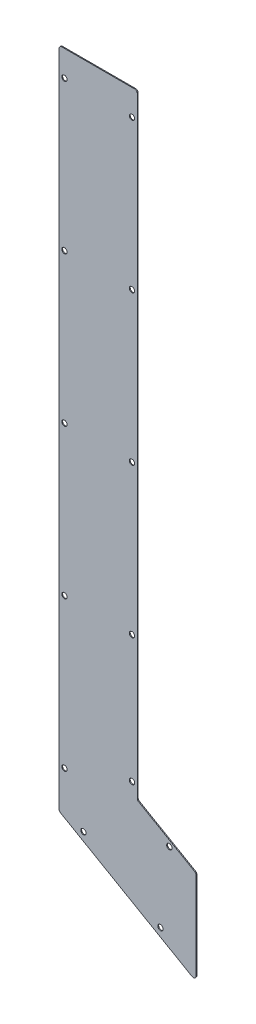
ISO-10303-21;
HEADER;
FILE_DESCRIPTION(('STEP AP214'),'2;1');
FILE_NAME('part.step','',(''),(''),'','','');
FILE_SCHEMA(('AUTOMOTIVE_DESIGN { 1 0 10303 214 1 1 1 1 }'));
ENDSEC;
DATA;
#1=APPLICATION_CONTEXT('core data for automotive mechanical design processes');
#2=APPLICATION_PROTOCOL_DEFINITION('international standard','automotive_design',2000,#1);
#3=PRODUCT_CONTEXT('',#1,'mechanical');
#4=PRODUCT('Part','Part','',(#3));
#5=PRODUCT_RELATED_PRODUCT_CATEGORY('part','',(#4));
#6=PRODUCT_DEFINITION_FORMATION('','',#4);
#7=PRODUCT_DEFINITION_CONTEXT('part definition',#1,'design');
#8=PRODUCT_DEFINITION('design','',#6,#7);
#9=PRODUCT_DEFINITION_SHAPE('','',#8);
#10=(LENGTH_UNIT() NAMED_UNIT(*) SI_UNIT(.MILLI.,.METRE.));
#11=(NAMED_UNIT(*) PLANE_ANGLE_UNIT() SI_UNIT($,.RADIAN.));
#12=(NAMED_UNIT(*) SI_UNIT($,.STERADIAN.) SOLID_ANGLE_UNIT());
#13=UNCERTAINTY_MEASURE_WITH_UNIT(LENGTH_MEASURE(1.E-05),#10,'distance_accuracy_value','');
#14=(GEOMETRIC_REPRESENTATION_CONTEXT(3) GLOBAL_UNCERTAINTY_ASSIGNED_CONTEXT((#13)) GLOBAL_UNIT_ASSIGNED_CONTEXT((#10,
#11,#12)) REPRESENTATION_CONTEXT('',''));
#15=CARTESIAN_POINT('',(0.,0.,0.));
#16=DIRECTION('',(0.,0.,1.));
#17=DIRECTION('',(1.,0.,0.));
#18=AXIS2_PLACEMENT_3D('',#15,#16,#17);
#19=CARTESIAN_POINT('',(104.,161.74,-1.));
#20=DIRECTION('',(1.,0.,0.));
#21=DIRECTION('',(0.,0.,-1.));
#22=AXIS2_PLACEMENT_3D('',#19,#20,#21);
#23=PLANE('',#22);
#24=DIRECTION('',(0.,1.,0.));
#25=VECTOR('',#24,1.);
#26=CARTESIAN_POINT('',(104.,161.74,0.));
#27=LINE('',#26,#25);
#28=CARTESIAN_POINT('',(104.,163.472050807569,0.));
#29=VERTEX_POINT('',#28);
#30=CARTESIAN_POINT('',(104.,850.,0.));
#31=VERTEX_POINT('',#30);
#32=EDGE_CURVE('E203',#29,#31,#27,.T.);
#33=ORIENTED_EDGE('',*,*,#32,.F.);
#34=DIRECTION('',(0.,0.,1.));
#35=VECTOR('',#34,1.);
#36=CARTESIAN_POINT('',(104.,163.472050807569,-1.));
#37=LINE('',#36,#35);
#38=CARTESIAN_POINT('',(104.,163.472050807569,-1.));
#39=VERTEX_POINT('',#38);
#40=EDGE_CURVE('E196',#29,#39,#37,.F.);
#41=ORIENTED_EDGE('',*,*,#40,.T.);
#42=DIRECTION('',(0.,1.,0.));
#43=VECTOR('',#42,1.);
#44=CARTESIAN_POINT('',(104.,161.74,-1.));
#45=LINE('',#44,#43);
#46=CARTESIAN_POINT('',(104.,850.,-1.));
#47=VERTEX_POINT('',#46);
#48=EDGE_CURVE('E220',#39,#47,#45,.T.);
#49=ORIENTED_EDGE('',*,*,#48,.T.);
#50=DIRECTION('',(0.,0.,1.));
#51=VECTOR('',#50,1.);
#52=CARTESIAN_POINT('',(104.,850.,-1.));
#53=LINE('',#52,#51);
#54=EDGE_CURVE('E193',#47,#31,#53,.T.);
#55=ORIENTED_EDGE('',*,*,#54,.T.);
#56=EDGE_LOOP('',(#33,#41,#49,#55));
#57=FACE_BOUND('',#56,.T.);
#58=ADVANCED_FACE('F41',(#57),#23,.T.);
#59=CARTESIAN_POINT('',(104.,161.74,-1.));
#60=DIRECTION('',(0.500000000000004,0.866025403784436,0.));
#61=DIRECTION('',(-0.866025403784436,0.500000000000004,0.));
#62=AXIS2_PLACEMENT_3D('',#59,#60,#61);
#63=PLANE('',#62);
#64=DIRECTION('',(-0.866025403784436,0.500000000000004,0.));
#65=VECTOR('',#64,1.);
#66=CARTESIAN_POINT('',(104.,161.74,-1.));
#67=LINE('',#66,#65);
#68=CARTESIAN_POINT('',(168.5,124.500907637269,-1.));
#69=VERTEX_POINT('',#68);
#70=CARTESIAN_POINT('',(105.5,160.873974596216,-1.));
#71=VERTEX_POINT('',#70);
#72=EDGE_CURVE('E153',#69,#71,#67,.T.);
#73=ORIENTED_EDGE('',*,*,#72,.T.);
#74=DIRECTION('',(0.,0.,1.));
#75=VECTOR('',#74,1.);
#76=CARTESIAN_POINT('',(105.5,160.873974596216,0.));
#77=LINE('',#76,#75);
#78=CARTESIAN_POINT('',(105.5,160.873974596216,0.));
#79=VERTEX_POINT('',#78);
#80=EDGE_CURVE('E190',#71,#79,#77,.T.);
#81=ORIENTED_EDGE('',*,*,#80,.T.);
#82=DIRECTION('',(-0.866025403784436,0.500000000000004,0.));
#83=VECTOR('',#82,1.);
#84=CARTESIAN_POINT('',(104.,161.74,0.));
#85=LINE('',#84,#83);
#86=CARTESIAN_POINT('',(168.5,124.500907637269,0.));
#87=VERTEX_POINT('',#86);
#88=EDGE_CURVE('E205',#87,#79,#85,.T.);
#89=ORIENTED_EDGE('',*,*,#88,.F.);
#90=DIRECTION('',(0.,0.,1.));
#91=VECTOR('',#90,1.);
#92=CARTESIAN_POINT('',(168.5,124.500907637269,-1.));
#93=LINE('',#92,#91);
#94=EDGE_CURVE('E188',#87,#69,#93,.F.);
#95=ORIENTED_EDGE('',*,*,#94,.T.);
#96=EDGE_LOOP('',(#73,#81,#89,#95));
#97=FACE_BOUND('',#96,.T.);
#98=ADVANCED_FACE('F222',(#97),#63,.T.);
#99=CARTESIAN_POINT('',(170.,123.634882233484,-1.));
#100=DIRECTION('',(1.,0.,0.));
#101=DIRECTION('',(0.,0.,-1.));
#102=AXIS2_PLACEMENT_3D('',#99,#100,#101);
#103=PLANE('',#102);
#104=DIRECTION('',(0.,1.,0.));
#105=VECTOR('',#104,1.);
#106=CARTESIAN_POINT('',(170.,123.634882233484,0.));
#107=LINE('',#106,#105);
#108=CARTESIAN_POINT('',(170.,23.4361524227066,0.));
#109=VERTEX_POINT('',#108);
#110=CARTESIAN_POINT('',(170.,121.902831425915,0.));
#111=VERTEX_POINT('',#110);
#112=EDGE_CURVE('E245',#109,#111,#107,.T.);
#113=ORIENTED_EDGE('',*,*,#112,.F.);
#114=DIRECTION('',(0.,0.,1.));
#115=VECTOR('',#114,1.);
#116=CARTESIAN_POINT('',(170.,23.4361524227066,-1.));
#117=LINE('',#116,#115);
#118=CARTESIAN_POINT('',(170.,23.4361524227066,-1.));
#119=VERTEX_POINT('',#118);
#120=EDGE_CURVE('E186',#109,#119,#117,.F.);
#121=ORIENTED_EDGE('',*,*,#120,.T.);
#122=DIRECTION('',(0.,1.,0.));
#123=VECTOR('',#122,1.);
#124=CARTESIAN_POINT('',(170.,123.634882233484,-1.));
#125=LINE('',#124,#123);
#126=CARTESIAN_POINT('',(170.,121.902831425915,-1.));
#127=VERTEX_POINT('',#126);
#128=EDGE_CURVE('E157',#119,#127,#125,.T.);
#129=ORIENTED_EDGE('',*,*,#128,.T.);
#130=DIRECTION('',(0.,0.,1.));
#131=VECTOR('',#130,1.);
#132=CARTESIAN_POINT('',(170.,121.902831425915,-1.));
#133=LINE('',#132,#131);
#134=EDGE_CURVE('E183',#127,#111,#133,.T.);
#135=ORIENTED_EDGE('',*,*,#134,.T.);
#136=EDGE_LOOP('',(#113,#121,#129,#135));
#137=FACE_BOUND('',#136,.T.);
#138=ADVANCED_FACE('F232',(#137),#103,.T.);
#139=CARTESIAN_POINT('',(170.,18.2399999999999,-1.));
#140=DIRECTION('',(-0.500000000000004,-0.866025403784436,0.));
#141=DIRECTION('',(0.866025403784436,-0.500000000000004,0.));
#142=AXIS2_PLACEMENT_3D('',#139,#140,#141);
#143=PLANE('',#142);
#144=DIRECTION('',(0.866025403784436,-0.500000000000004,0.));
#145=VECTOR('',#144,1.);
#146=CARTESIAN_POINT('',(170.,18.2399999999999,0.));
#147=LINE('',#146,#145);
#148=CARTESIAN_POINT('',(17.5000000000001,106.285916051419,0.));
#149=VERTEX_POINT('',#148);
#150=CARTESIAN_POINT('',(165.5,20.8380762113533,0.));
#151=VERTEX_POINT('',#150);
#152=EDGE_CURVE('E150',#149,#151,#147,.T.);
#153=ORIENTED_EDGE('',*,*,#152,.F.);
#154=DIRECTION('',(0.,0.,1.));
#155=VECTOR('',#154,1.);
#156=CARTESIAN_POINT('',(17.5000000000001,106.285916051419,-1.));
#157=LINE('',#156,#155);
#158=CARTESIAN_POINT('',(17.5000000000001,106.285916051419,-1.));
#159=VERTEX_POINT('',#158);
#160=EDGE_CURVE('E172',#149,#159,#157,.F.);
#161=ORIENTED_EDGE('',*,*,#160,.T.);
#162=DIRECTION('',(0.866025403784436,-0.500000000000004,0.));
#163=VECTOR('',#162,1.);
#164=CARTESIAN_POINT('',(170.,18.2399999999999,-1.));
#165=LINE('',#164,#163);
#166=CARTESIAN_POINT('',(165.5,20.8380762113533,-1.));
#167=VERTEX_POINT('',#166);
#168=EDGE_CURVE('E235',#159,#167,#165,.T.);
#169=ORIENTED_EDGE('',*,*,#168,.T.);
#170=DIRECTION('',(0.,0.,1.));
#171=VECTOR('',#170,1.);
#172=CARTESIAN_POINT('',(165.5,20.8380762113533,-1.));
#173=LINE('',#172,#171);
#174=EDGE_CURVE('E169',#167,#151,#173,.T.);
#175=ORIENTED_EDGE('',*,*,#174,.T.);
#176=EDGE_LOOP('',(#153,#161,#169,#175));
#177=FACE_BOUND('',#176,.T.);
#178=ADVANCED_FACE('F340',(#177),#143,.T.);
#179=CARTESIAN_POINT('',(16.,853.,-1.));
#180=DIRECTION('',(-1.,0.,0.));
#181=DIRECTION('',(0.,-1.,0.));
#182=AXIS2_PLACEMENT_3D('',#179,#180,#181);
#183=PLANE('',#182);
#184=DIRECTION('',(0.,-1.,0.));
#185=VECTOR('',#184,1.);
#186=CARTESIAN_POINT('',(16.,853.,-1.));
#187=LINE('',#186,#185);
#188=CARTESIAN_POINT('',(16.,850.,-1.));
#189=VERTEX_POINT('',#188);
#190=CARTESIAN_POINT('',(16.0000000000001,108.883992262772,-1.));
#191=VERTEX_POINT('',#190);
#192=EDGE_CURVE('E238',#189,#191,#187,.T.);
#193=ORIENTED_EDGE('',*,*,#192,.T.);
#194=DIRECTION('',(0.,0.,1.));
#195=VECTOR('',#194,1.);
#196=CARTESIAN_POINT('',(16.0000000000001,108.883992262772,-1.));
#197=LINE('',#196,#195);
#198=CARTESIAN_POINT('',(16.0000000000001,108.883992262772,0.));
#199=VERTEX_POINT('',#198);
#200=EDGE_CURVE('E149',#191,#199,#197,.T.);
#201=ORIENTED_EDGE('',*,*,#200,.T.);
#202=DIRECTION('',(0.,-1.,0.));
#203=VECTOR('',#202,1.);
#204=CARTESIAN_POINT('',(16.,853.,0.));
#205=LINE('',#204,#203);
#206=CARTESIAN_POINT('',(16.,850.,0.));
#207=VERTEX_POINT('',#206);
#208=EDGE_CURVE('E134',#207,#199,#205,.T.);
#209=ORIENTED_EDGE('',*,*,#208,.F.);
#210=DIRECTION('',(0.,0.,1.));
#211=VECTOR('',#210,1.);
#212=CARTESIAN_POINT('',(16.,850.,-1.));
#213=LINE('',#212,#211);
#214=EDGE_CURVE('E147',#207,#189,#213,.F.);
#215=ORIENTED_EDGE('',*,*,#214,.T.);
#216=EDGE_LOOP('',(#193,#201,#209,#215));
#217=FACE_BOUND('',#216,.T.);
#218=ADVANCED_FACE('F146',(#217),#183,.T.);
#219=CARTESIAN_POINT('',(104.,853.,-1.));
#220=DIRECTION('',(0.,1.,0.));
#221=DIRECTION('',(0.,0.,1.));
#222=AXIS2_PLACEMENT_3D('',#219,#220,#221);
#223=PLANE('',#222);
#224=DIRECTION('',(-1.,0.,0.));
#225=VECTOR('',#224,1.);
#226=CARTESIAN_POINT('',(104.,853.,-1.));
#227=LINE('',#226,#225);
#228=CARTESIAN_POINT('',(101.,853.,-1.));
#229=VERTEX_POINT('',#228);
#230=CARTESIAN_POINT('',(19.,853.,-1.));
#231=VERTEX_POINT('',#230);
#232=EDGE_CURVE('E333',#229,#231,#227,.T.);
#233=ORIENTED_EDGE('',*,*,#232,.T.);
#234=DIRECTION('',(0.,0.,1.));
#235=VECTOR('',#234,1.);
#236=CARTESIAN_POINT('',(19.,853.,-1.));
#237=LINE('',#236,#235);
#238=CARTESIAN_POINT('',(19.,853.,0.));
#239=VERTEX_POINT('',#238);
#240=EDGE_CURVE('E199',#231,#239,#237,.T.);
#241=ORIENTED_EDGE('',*,*,#240,.T.);
#242=DIRECTION('',(-1.,0.,0.));
#243=VECTOR('',#242,1.);
#244=CARTESIAN_POINT('',(104.,853.,0.));
#245=LINE('',#244,#243);
#246=CARTESIAN_POINT('',(101.,853.,0.));
#247=VERTEX_POINT('',#246);
#248=EDGE_CURVE('E135',#247,#239,#245,.T.);
#249=ORIENTED_EDGE('',*,*,#248,.F.);
#250=DIRECTION('',(0.,0.,1.));
#251=VECTOR('',#250,1.);
#252=CARTESIAN_POINT('',(101.,853.,-1.));
#253=LINE('',#252,#251);
#254=EDGE_CURVE('E63',#247,#229,#253,.F.);
#255=ORIENTED_EDGE('',*,*,#254,.T.);
#256=EDGE_LOOP('',(#233,#241,#249,#255));
#257=FACE_BOUND('',#256,.T.);
#258=ADVANCED_FACE('F359',(#257),#223,.T.);
#259=CARTESIAN_POINT('',(0.,0.,-1.));
#260=DIRECTION('',(0.,0.,1.));
#261=DIRECTION('',(1.,0.,0.));
#262=AXIS2_PLACEMENT_3D('',#259,#260,#261);
#263=PLANE('',#262);
#264=CARTESIAN_POINT('',(21.9999999999822,488.,-1.));
#265=DIRECTION('',(0.,0.,-1.));
#266=DIRECTION('',(-1.,0.,0.));
#267=AXIS2_PLACEMENT_3D('',#264,#265,#266);
#268=CIRCLE('',#267,3.);
#269=CARTESIAN_POINT('',(18.9999999999822,488.,-1.));
#270=VERTEX_POINT('',#269);
#271=EDGE_CURVE('E421',#270,#270,#268,.T.);
#272=ORIENTED_EDGE('',*,*,#271,.F.);
#273=EDGE_LOOP('',(#272));
#274=FACE_BOUND('',#273,.T.);
#275=CARTESIAN_POINT('',(21.9999999999911,656.,-1.));
#276=DIRECTION('',(0.,0.,-1.));
#277=DIRECTION('',(-1.,0.,0.));
#278=AXIS2_PLACEMENT_3D('',#275,#276,#277);
#279=CIRCLE('',#278,3.);
#280=CARTESIAN_POINT('',(18.9999999999911,656.,-1.));
#281=VERTEX_POINT('',#280);
#282=EDGE_CURVE('E425',#281,#281,#279,.T.);
#283=ORIENTED_EDGE('',*,*,#282,.F.);
#284=EDGE_LOOP('',(#283));
#285=FACE_BOUND('',#284,.T.);
#286=CARTESIAN_POINT('',(140.,134.564882233484,-1.));
#287=DIRECTION('',(0.,0.,-1.));
#288=DIRECTION('',(-1.,0.,0.));
#289=AXIS2_PLACEMENT_3D('',#286,#287,#288);
#290=CIRCLE('',#289,2.99999999999999);
#291=CARTESIAN_POINT('',(137.,134.564882233484,-1.));
#292=VERTEX_POINT('',#291);
#293=EDGE_CURVE('E440',#292,#292,#290,.T.);
#294=ORIENTED_EDGE('',*,*,#293,.F.);
#295=EDGE_LOOP('',(#294));
#296=FACE_BOUND('',#295,.T.);
#297=CARTESIAN_POINT('',(97.9999999999661,319.999999999996,-1.));
#298=DIRECTION('',(0.,0.,-1.));
#299=DIRECTION('',(-1.,0.,0.));
#300=AXIS2_PLACEMENT_3D('',#297,#298,#299);
#301=CIRCLE('',#300,3.00000000000001);
#302=CARTESIAN_POINT('',(94.9999999999661,319.999999999996,-1.));
#303=VERTEX_POINT('',#302);
#304=EDGE_CURVE('E436',#303,#303,#301,.T.);
#305=ORIENTED_EDGE('',*,*,#304,.F.);
#306=EDGE_LOOP('',(#305));
#307=FACE_BOUND('',#306,.T.);
#308=CARTESIAN_POINT('',(97.9999999999661,177.,-1.));
#309=DIRECTION('',(0.,0.,-1.));
#310=DIRECTION('',(-1.,0.,0.));
#311=AXIS2_PLACEMENT_3D('',#308,#309,#310);
#312=CIRCLE('',#311,3.00000000000001);
#313=CARTESIAN_POINT('',(94.9999999999661,177.,-1.));
#314=VERTEX_POINT('',#313);
#315=EDGE_CURVE('E325',#314,#314,#312,.T.);
#316=ORIENTED_EDGE('',*,*,#315,.F.);
#317=EDGE_LOOP('',(#316));
#318=FACE_BOUND('',#317,.T.);
#319=CARTESIAN_POINT('',(98.,823.999999999995,-1.));
#320=DIRECTION('',(0.,0.,-1.));
#321=DIRECTION('',(-1.,0.,0.));
#322=AXIS2_PLACEMENT_3D('',#319,#320,#321);
#323=CIRCLE('',#322,3.00000000000001);
#324=CARTESIAN_POINT('',(95.,823.999999999995,-1.));
#325=VERTEX_POINT('',#324);
#326=EDGE_CURVE('E328',#325,#325,#323,.T.);
#327=ORIENTED_EDGE('',*,*,#326,.F.);
#328=EDGE_LOOP('',(#327));
#329=FACE_BOUND('',#328,.T.);
#330=CARTESIAN_POINT('',(97.9999999999887,655.999999999995,-1.));
#331=DIRECTION('',(0.,0.,-1.));
#332=DIRECTION('',(-1.,0.,0.));
#333=AXIS2_PLACEMENT_3D('',#330,#331,#332);
#334=CIRCLE('',#333,3.00000000000001);
#335=CARTESIAN_POINT('',(94.9999999999887,655.999999999995,-1.));
#336=VERTEX_POINT('',#335);
#337=EDGE_CURVE('E445',#336,#336,#334,.T.);
#338=ORIENTED_EDGE('',*,*,#337,.F.);
#339=EDGE_LOOP('',(#338));
#340=FACE_BOUND('',#339,.T.);
#341=CARTESIAN_POINT('',(97.9999999999774,487.999999999995,-1.));
#342=DIRECTION('',(0.,0.,-1.));
#343=DIRECTION('',(-1.,0.,0.));
#344=AXIS2_PLACEMENT_3D('',#341,#342,#343);
#345=CIRCLE('',#344,3.00000000000001);
#346=CARTESIAN_POINT('',(94.9999999999774,487.999999999995,-1.));
#347=VERTEX_POINT('',#346);
#348=EDGE_CURVE('E439',#347,#347,#345,.T.);
#349=ORIENTED_EDGE('',*,*,#348,.F.);
#350=EDGE_LOOP('',(#349));
#351=FACE_BOUND('',#350,.T.);
#352=CARTESIAN_POINT('',(21.9999999999732,320.,-1.));
#353=DIRECTION('',(0.,0.,-1.));
#354=DIRECTION('',(-1.,0.,0.));
#355=AXIS2_PLACEMENT_3D('',#352,#353,#354);
#356=CIRCLE('',#355,3.);
#357=CARTESIAN_POINT('',(18.9999999999732,320.,-1.));
#358=VERTEX_POINT('',#357);
#359=EDGE_CURVE('E419',#358,#358,#356,.T.);
#360=ORIENTED_EDGE('',*,*,#359,.F.);
#361=EDGE_LOOP('',(#360));
#362=FACE_BOUND('',#361,.T.);
#363=CARTESIAN_POINT('',(21.9999999999548,152.,-1.));
#364=DIRECTION('',(0.,0.,-1.));
#365=DIRECTION('',(-1.,0.,0.));
#366=AXIS2_PLACEMENT_3D('',#363,#364,#365);
#367=CIRCLE('',#366,3.);
#368=CARTESIAN_POINT('',(18.9999999999548,152.,-1.));
#369=VERTEX_POINT('',#368);
#370=EDGE_CURVE('E422',#369,#369,#367,.T.);
#371=ORIENTED_EDGE('',*,*,#370,.F.);
#372=EDGE_LOOP('',(#371));
#373=FACE_BOUND('',#372,.T.);
#374=CARTESIAN_POINT('',(130.,50.7348822334842,-1.));
#375=DIRECTION('',(0.,0.,-1.));
#376=DIRECTION('',(-1.,0.,0.));
#377=AXIS2_PLACEMENT_3D('',#374,#375,#376);
#378=CIRCLE('',#377,2.99999999999999);
#379=CARTESIAN_POINT('',(127.,50.7348822334842,-1.));
#380=VERTEX_POINT('',#379);
#381=EDGE_CURVE('E428',#380,#380,#378,.T.);
#382=ORIENTED_EDGE('',*,*,#381,.F.);
#383=EDGE_LOOP('',(#382));
#384=FACE_BOUND('',#383,.T.);
#385=CARTESIAN_POINT('',(43.3974596215561,100.734882233484,-1.));
#386=DIRECTION('',(0.,0.,-1.));
#387=DIRECTION('',(-1.,0.,0.));
#388=AXIS2_PLACEMENT_3D('',#385,#386,#387);
#389=CIRCLE('',#388,3.);
#390=CARTESIAN_POINT('',(40.3974596215561,100.734882233484,-1.));
#391=VERTEX_POINT('',#390);
#392=EDGE_CURVE('E433',#391,#391,#389,.T.);
#393=ORIENTED_EDGE('',*,*,#392,.F.);
#394=EDGE_LOOP('',(#393));
#395=FACE_BOUND('',#394,.T.);
#396=CARTESIAN_POINT('',(22.,824.,-1.));
#397=DIRECTION('',(0.,0.,-1.));
#398=DIRECTION('',(-1.,0.,0.));
#399=AXIS2_PLACEMENT_3D('',#396,#397,#398);
#400=CIRCLE('',#399,3.);
#401=CARTESIAN_POINT('',(19.,824.,-1.));
#402=VERTEX_POINT('',#401);
#403=EDGE_CURVE('E252',#402,#402,#400,.T.);
#404=ORIENTED_EDGE('',*,*,#403,.F.);
#405=EDGE_LOOP('',(#404));
#406=FACE_BOUND('',#405,.T.);
#407=ORIENTED_EDGE('',*,*,#168,.F.);
#408=CARTESIAN_POINT('',(19.0000000000001,108.883992262772,-1.));
#409=DIRECTION('',(0.,0.,1.));
#410=DIRECTION('',(1.,0.,0.));
#411=AXIS2_PLACEMENT_3D('',#408,#409,#410);
#412=CIRCLE('',#411,3.);
#413=EDGE_CURVE('E181',#159,#191,#412,.F.);
#414=ORIENTED_EDGE('',*,*,#413,.T.);
#415=ORIENTED_EDGE('',*,*,#192,.F.);
#416=CARTESIAN_POINT('',(19.,850.,-1.));
#417=DIRECTION('',(0.,0.,1.));
#418=DIRECTION('',(1.,0.,0.));
#419=AXIS2_PLACEMENT_3D('',#416,#417,#418);
#420=CIRCLE('',#419,3.);
#421=EDGE_CURVE('E56',#189,#231,#420,.F.);
#422=ORIENTED_EDGE('',*,*,#421,.T.);
#423=ORIENTED_EDGE('',*,*,#232,.F.);
#424=CARTESIAN_POINT('',(101.,850.,-1.));
#425=DIRECTION('',(0.,0.,1.));
#426=DIRECTION('',(1.,0.,0.));
#427=AXIS2_PLACEMENT_3D('',#424,#425,#426);
#428=CIRCLE('',#427,3.);
#429=EDGE_CURVE('E174',#229,#47,#428,.F.);
#430=ORIENTED_EDGE('',*,*,#429,.T.);
#431=ORIENTED_EDGE('',*,*,#48,.F.);
#432=CARTESIAN_POINT('',(107.,163.472050807569,-1.));
#433=DIRECTION('',(0.,0.,1.));
#434=DIRECTION('',(1.,0.,0.));
#435=AXIS2_PLACEMENT_3D('',#432,#433,#434);
#436=CIRCLE('',#435,3.);
#437=EDGE_CURVE('E11',#39,#71,#436,.T.);
#438=ORIENTED_EDGE('',*,*,#437,.T.);
#439=ORIENTED_EDGE('',*,*,#72,.F.);
#440=CARTESIAN_POINT('',(167.,121.902831425915,-1.));
#441=DIRECTION('',(0.,0.,1.));
#442=DIRECTION('',(1.,0.,0.));
#443=AXIS2_PLACEMENT_3D('',#440,#441,#442);
#444=CIRCLE('',#443,3.);
#445=EDGE_CURVE('E177',#69,#127,#444,.F.);
#446=ORIENTED_EDGE('',*,*,#445,.T.);
#447=ORIENTED_EDGE('',*,*,#128,.F.);
#448=CARTESIAN_POINT('',(167.,23.4361524227066,-1.));
#449=DIRECTION('',(0.,0.,1.));
#450=DIRECTION('',(1.,0.,0.));
#451=AXIS2_PLACEMENT_3D('',#448,#449,#450);
#452=CIRCLE('',#451,3.);
#453=EDGE_CURVE('E179',#119,#167,#452,.F.);
#454=ORIENTED_EDGE('',*,*,#453,.T.);
#455=EDGE_LOOP('',(#407,#414,#415,#422,#423,#430,#431,#438,#439,#446,#447,#454));
#456=FACE_BOUND('',#455,.T.);
#457=ADVANCED_FACE('F218',(#274,#285,#296,#307,#318,#329,#340,#351,#362,#373,#384,#395,#406,
#456),#263,.F.);
#458=CARTESIAN_POINT('',(0.,0.,0.));
#459=DIRECTION('',(0.,0.,1.));
#460=DIRECTION('',(1.,0.,0.));
#461=AXIS2_PLACEMENT_3D('',#458,#459,#460);
#462=PLANE('',#461);
#463=CARTESIAN_POINT('',(21.9999999999822,488.,0.));
#464=DIRECTION('',(0.,0.,1.));
#465=DIRECTION('',(1.,0.,0.));
#466=AXIS2_PLACEMENT_3D('',#463,#464,#465);
#467=CIRCLE('',#466,3.);
#468=CARTESIAN_POINT('',(24.9999999999822,488.,0.));
#469=VERTEX_POINT('',#468);
#470=EDGE_CURVE('E160',#469,#469,#467,.T.);
#471=ORIENTED_EDGE('',*,*,#470,.F.);
#472=EDGE_LOOP('',(#471));
#473=FACE_BOUND('',#472,.T.);
#474=CARTESIAN_POINT('',(21.9999999999911,656.,0.));
#475=DIRECTION('',(0.,0.,1.));
#476=DIRECTION('',(1.,0.,0.));
#477=AXIS2_PLACEMENT_3D('',#474,#475,#476);
#478=CIRCLE('',#477,3.);
#479=CARTESIAN_POINT('',(24.9999999999911,656.,0.));
#480=VERTEX_POINT('',#479);
#481=EDGE_CURVE('E281',#480,#480,#478,.T.);
#482=ORIENTED_EDGE('',*,*,#481,.F.);
#483=EDGE_LOOP('',(#482));
#484=FACE_BOUND('',#483,.T.);
#485=CARTESIAN_POINT('',(140.,134.564882233484,0.));
#486=DIRECTION('',(0.,0.,1.));
#487=DIRECTION('',(1.,0.,0.));
#488=AXIS2_PLACEMENT_3D('',#485,#486,#487);
#489=CIRCLE('',#488,2.99999999999999);
#490=CARTESIAN_POINT('',(143.,134.564882233484,0.));
#491=VERTEX_POINT('',#490);
#492=EDGE_CURVE('E279',#491,#491,#489,.T.);
#493=ORIENTED_EDGE('',*,*,#492,.F.);
#494=EDGE_LOOP('',(#493));
#495=FACE_BOUND('',#494,.T.);
#496=CARTESIAN_POINT('',(97.9999999999661,319.999999999996,0.));
#497=DIRECTION('',(0.,0.,1.));
#498=DIRECTION('',(1.,0.,0.));
#499=AXIS2_PLACEMENT_3D('',#496,#497,#498);
#500=CIRCLE('',#499,3.00000000000001);
#501=CARTESIAN_POINT('',(100.999999999966,319.999999999996,0.));
#502=VERTEX_POINT('',#501);
#503=EDGE_CURVE('E276',#502,#502,#500,.T.);
#504=ORIENTED_EDGE('',*,*,#503,.F.);
#505=EDGE_LOOP('',(#504));
#506=FACE_BOUND('',#505,.T.);
#507=CARTESIAN_POINT('',(97.9999999999661,177.,0.));
#508=DIRECTION('',(0.,0.,1.));
#509=DIRECTION('',(1.,0.,0.));
#510=AXIS2_PLACEMENT_3D('',#507,#508,#509);
#511=CIRCLE('',#510,3.00000000000001);
#512=CARTESIAN_POINT('',(100.999999999966,177.,0.));
#513=VERTEX_POINT('',#512);
#514=EDGE_CURVE('E273',#513,#513,#511,.T.);
#515=ORIENTED_EDGE('',*,*,#514,.F.);
#516=EDGE_LOOP('',(#515));
#517=FACE_BOUND('',#516,.T.);
#518=CARTESIAN_POINT('',(98.,823.999999999995,0.));
#519=DIRECTION('',(0.,0.,1.));
#520=DIRECTION('',(1.,0.,0.));
#521=AXIS2_PLACEMENT_3D('',#518,#519,#520);
#522=CIRCLE('',#521,3.00000000000001);
#523=CARTESIAN_POINT('',(101.,823.999999999995,0.));
#524=VERTEX_POINT('',#523);
#525=EDGE_CURVE('E270',#524,#524,#522,.T.);
#526=ORIENTED_EDGE('',*,*,#525,.F.);
#527=EDGE_LOOP('',(#526));
#528=FACE_BOUND('',#527,.T.);
#529=CARTESIAN_POINT('',(97.9999999999887,655.999999999995,0.));
#530=DIRECTION('',(0.,0.,1.));
#531=DIRECTION('',(1.,0.,0.));
#532=AXIS2_PLACEMENT_3D('',#529,#530,#531);
#533=CIRCLE('',#532,3.00000000000001);
#534=CARTESIAN_POINT('',(100.999999999989,655.999999999995,0.));
#535=VERTEX_POINT('',#534);
#536=EDGE_CURVE('E267',#535,#535,#533,.T.);
#537=ORIENTED_EDGE('',*,*,#536,.F.);
#538=EDGE_LOOP('',(#537));
#539=FACE_BOUND('',#538,.T.);
#540=CARTESIAN_POINT('',(97.9999999999774,487.999999999995,0.));
#541=DIRECTION('',(0.,0.,1.));
#542=DIRECTION('',(1.,0.,0.));
#543=AXIS2_PLACEMENT_3D('',#540,#541,#542);
#544=CIRCLE('',#543,3.00000000000001);
#545=CARTESIAN_POINT('',(100.999999999977,487.999999999995,0.));
#546=VERTEX_POINT('',#545);
#547=EDGE_CURVE('E264',#546,#546,#544,.T.);
#548=ORIENTED_EDGE('',*,*,#547,.F.);
#549=EDGE_LOOP('',(#548));
#550=FACE_BOUND('',#549,.T.);
#551=CARTESIAN_POINT('',(21.9999999999732,320.,0.));
#552=DIRECTION('',(0.,0.,1.));
#553=DIRECTION('',(1.,0.,0.));
#554=AXIS2_PLACEMENT_3D('',#551,#552,#553);
#555=CIRCLE('',#554,3.);
#556=CARTESIAN_POINT('',(24.9999999999732,320.,0.));
#557=VERTEX_POINT('',#556);
#558=EDGE_CURVE('E261',#557,#557,#555,.T.);
#559=ORIENTED_EDGE('',*,*,#558,.F.);
#560=EDGE_LOOP('',(#559));
#561=FACE_BOUND('',#560,.T.);
#562=CARTESIAN_POINT('',(21.9999999999548,152.,0.));
#563=DIRECTION('',(0.,0.,1.));
#564=DIRECTION('',(1.,0.,0.));
#565=AXIS2_PLACEMENT_3D('',#562,#563,#564);
#566=CIRCLE('',#565,3.);
#567=CARTESIAN_POINT('',(24.9999999999548,152.,0.));
#568=VERTEX_POINT('',#567);
#569=EDGE_CURVE('E258',#568,#568,#566,.T.);
#570=ORIENTED_EDGE('',*,*,#569,.F.);
#571=EDGE_LOOP('',(#570));
#572=FACE_BOUND('',#571,.T.);
#573=CARTESIAN_POINT('',(130.,50.7348822334842,0.));
#574=DIRECTION('',(0.,0.,1.));
#575=DIRECTION('',(1.,0.,0.));
#576=AXIS2_PLACEMENT_3D('',#573,#574,#575);
#577=CIRCLE('',#576,2.99999999999999);
#578=CARTESIAN_POINT('',(133.,50.7348822334842,0.));
#579=VERTEX_POINT('',#578);
#580=EDGE_CURVE('E255',#579,#579,#577,.T.);
#581=ORIENTED_EDGE('',*,*,#580,.F.);
#582=EDGE_LOOP('',(#581));
#583=FACE_BOUND('',#582,.T.);
#584=CARTESIAN_POINT('',(43.3974596215561,100.734882233484,0.));
#585=DIRECTION('',(0.,0.,1.));
#586=DIRECTION('',(1.,0.,0.));
#587=AXIS2_PLACEMENT_3D('',#584,#585,#586);
#588=CIRCLE('',#587,3.);
#589=CARTESIAN_POINT('',(46.3974596215561,100.734882233484,0.));
#590=VERTEX_POINT('',#589);
#591=EDGE_CURVE('E251',#590,#590,#588,.T.);
#592=ORIENTED_EDGE('',*,*,#591,.F.);
#593=EDGE_LOOP('',(#592));
#594=FACE_BOUND('',#593,.T.);
#595=CARTESIAN_POINT('',(22.,824.,0.));
#596=DIRECTION('',(0.,0.,1.));
#597=DIRECTION('',(1.,0.,0.));
#598=AXIS2_PLACEMENT_3D('',#595,#596,#597);
#599=CIRCLE('',#598,3.);
#600=CARTESIAN_POINT('',(25.,824.,0.));
#601=VERTEX_POINT('',#600);
#602=EDGE_CURVE('E248',#601,#601,#599,.T.);
#603=ORIENTED_EDGE('',*,*,#602,.F.);
#604=EDGE_LOOP('',(#603));
#605=FACE_BOUND('',#604,.T.);
#606=ORIENTED_EDGE('',*,*,#208,.T.);
#607=CARTESIAN_POINT('',(19.0000000000001,108.883992262772,0.));
#608=DIRECTION('',(0.,0.,1.));
#609=DIRECTION('',(1.,0.,0.));
#610=AXIS2_PLACEMENT_3D('',#607,#608,#609);
#611=CIRCLE('',#610,3.);
#612=EDGE_CURVE('E167',#199,#149,#611,.T.);
#613=ORIENTED_EDGE('',*,*,#612,.T.);
#614=ORIENTED_EDGE('',*,*,#152,.T.);
#615=CARTESIAN_POINT('',(167.,23.4361524227066,0.));
#616=DIRECTION('',(0.,0.,1.));
#617=DIRECTION('',(1.,0.,0.));
#618=AXIS2_PLACEMENT_3D('',#615,#616,#617);
#619=CIRCLE('',#618,3.);
#620=EDGE_CURVE('E165',#151,#109,#619,.T.);
#621=ORIENTED_EDGE('',*,*,#620,.T.);
#622=ORIENTED_EDGE('',*,*,#112,.T.);
#623=CARTESIAN_POINT('',(167.,121.902831425915,0.));
#624=DIRECTION('',(0.,0.,1.));
#625=DIRECTION('',(1.,0.,0.));
#626=AXIS2_PLACEMENT_3D('',#623,#624,#625);
#627=CIRCLE('',#626,3.);
#628=EDGE_CURVE('E140',#111,#87,#627,.T.);
#629=ORIENTED_EDGE('',*,*,#628,.T.);
#630=ORIENTED_EDGE('',*,*,#88,.T.);
#631=CARTESIAN_POINT('',(107.,163.472050807569,0.));
#632=DIRECTION('',(0.,0.,1.));
#633=DIRECTION('',(1.,0.,0.));
#634=AXIS2_PLACEMENT_3D('',#631,#632,#633);
#635=CIRCLE('',#634,3.);
#636=EDGE_CURVE('E49',#79,#29,#635,.F.);
#637=ORIENTED_EDGE('',*,*,#636,.T.);
#638=ORIENTED_EDGE('',*,*,#32,.T.);
#639=CARTESIAN_POINT('',(101.,850.,0.));
#640=DIRECTION('',(0.,0.,1.));
#641=DIRECTION('',(1.,0.,0.));
#642=AXIS2_PLACEMENT_3D('',#639,#640,#641);
#643=CIRCLE('',#642,3.);
#644=EDGE_CURVE('E141',#31,#247,#643,.T.);
#645=ORIENTED_EDGE('',*,*,#644,.T.);
#646=ORIENTED_EDGE('',*,*,#248,.T.);
#647=CARTESIAN_POINT('',(19.,850.,0.));
#648=DIRECTION('',(0.,0.,1.));
#649=DIRECTION('',(1.,0.,0.));
#650=AXIS2_PLACEMENT_3D('',#647,#648,#649);
#651=CIRCLE('',#650,3.);
#652=EDGE_CURVE('E131',#239,#207,#651,.T.);
#653=ORIENTED_EDGE('',*,*,#652,.T.);
#654=EDGE_LOOP('',(#606,#613,#614,#621,#622,#629,#630,#637,#638,#645,#646,#653));
#655=FACE_BOUND('',#654,.T.);
#656=ADVANCED_FACE('F133',(#473,#484,#495,#506,#517,#528,#539,#550,#561,#572,#583,#594,#605,
#655),#462,.T.);
#657=CARTESIAN_POINT('',(22.,824.,9.));
#658=DIRECTION('',(0.,0.,-1.));
#659=DIRECTION('',(-1.,0.,0.));
#660=AXIS2_PLACEMENT_3D('',#657,#658,#659);
#661=CYLINDRICAL_SURFACE('',#660,3.);
#662=ORIENTED_EDGE('',*,*,#602,.T.);
#663=EDGE_LOOP('',(#662));
#664=FACE_BOUND('',#663,.T.);
#665=ORIENTED_EDGE('',*,*,#403,.T.);
#666=EDGE_LOOP('',(#665));
#667=FACE_BOUND('',#666,.T.);
#668=ADVANCED_FACE('F293',(#664,#667),#661,.F.);
#669=CARTESIAN_POINT('',(43.3974596215561,100.734882233484,9.));
#670=DIRECTION('',(0.,0.,-1.));
#671=DIRECTION('',(-1.,0.,0.));
#672=AXIS2_PLACEMENT_3D('',#669,#670,#671);
#673=CYLINDRICAL_SURFACE('',#672,3.);
#674=ORIENTED_EDGE('',*,*,#591,.T.);
#675=EDGE_LOOP('',(#674));
#676=FACE_BOUND('',#675,.T.);
#677=ORIENTED_EDGE('',*,*,#392,.T.);
#678=EDGE_LOOP('',(#677));
#679=FACE_BOUND('',#678,.T.);
#680=ADVANCED_FACE('F320',(#676,#679),#673,.F.);
#681=CARTESIAN_POINT('',(130.,50.7348822334842,9.));
#682=DIRECTION('',(0.,0.,-1.));
#683=DIRECTION('',(-1.,0.,0.));
#684=AXIS2_PLACEMENT_3D('',#681,#682,#683);
#685=CYLINDRICAL_SURFACE('',#684,2.99999999999999);
#686=ORIENTED_EDGE('',*,*,#580,.T.);
#687=EDGE_LOOP('',(#686));
#688=FACE_BOUND('',#687,.T.);
#689=ORIENTED_EDGE('',*,*,#381,.T.);
#690=EDGE_LOOP('',(#689));
#691=FACE_BOUND('',#690,.T.);
#692=ADVANCED_FACE('F403',(#688,#691),#685,.F.);
#693=CARTESIAN_POINT('',(21.9999999999548,152.,9.));
#694=DIRECTION('',(0.,0.,-1.));
#695=DIRECTION('',(-1.,0.,0.));
#696=AXIS2_PLACEMENT_3D('',#693,#694,#695);
#697=CYLINDRICAL_SURFACE('',#696,3.);
#698=ORIENTED_EDGE('',*,*,#569,.T.);
#699=EDGE_LOOP('',(#698));
#700=FACE_BOUND('',#699,.T.);
#701=ORIENTED_EDGE('',*,*,#370,.T.);
#702=EDGE_LOOP('',(#701));
#703=FACE_BOUND('',#702,.T.);
#704=ADVANCED_FACE('F407',(#700,#703),#697,.F.);
#705=CARTESIAN_POINT('',(21.9999999999732,320.,9.));
#706=DIRECTION('',(0.,0.,-1.));
#707=DIRECTION('',(-1.,0.,0.));
#708=AXIS2_PLACEMENT_3D('',#705,#706,#707);
#709=CYLINDRICAL_SURFACE('',#708,3.);
#710=ORIENTED_EDGE('',*,*,#558,.T.);
#711=EDGE_LOOP('',(#710));
#712=FACE_BOUND('',#711,.T.);
#713=ORIENTED_EDGE('',*,*,#359,.T.);
#714=EDGE_LOOP('',(#713));
#715=FACE_BOUND('',#714,.T.);
#716=ADVANCED_FACE('F384',(#712,#715),#709,.F.);
#717=CARTESIAN_POINT('',(97.9999999999774,487.999999999995,9.));
#718=DIRECTION('',(0.,0.,-1.));
#719=DIRECTION('',(-1.,0.,0.));
#720=AXIS2_PLACEMENT_3D('',#717,#718,#719);
#721=CYLINDRICAL_SURFACE('',#720,3.00000000000001);
#722=ORIENTED_EDGE('',*,*,#547,.T.);
#723=EDGE_LOOP('',(#722));
#724=FACE_BOUND('',#723,.T.);
#725=ORIENTED_EDGE('',*,*,#348,.T.);
#726=EDGE_LOOP('',(#725));
#727=FACE_BOUND('',#726,.T.);
#728=ADVANCED_FACE('F381',(#724,#727),#721,.F.);
#729=CARTESIAN_POINT('',(97.9999999999887,655.999999999995,9.));
#730=DIRECTION('',(0.,0.,-1.));
#731=DIRECTION('',(-1.,0.,0.));
#732=AXIS2_PLACEMENT_3D('',#729,#730,#731);
#733=CYLINDRICAL_SURFACE('',#732,3.00000000000001);
#734=ORIENTED_EDGE('',*,*,#536,.T.);
#735=EDGE_LOOP('',(#734));
#736=FACE_BOUND('',#735,.T.);
#737=ORIENTED_EDGE('',*,*,#337,.T.);
#738=EDGE_LOOP('',(#737));
#739=FACE_BOUND('',#738,.T.);
#740=ADVANCED_FACE('F375',(#736,#739),#733,.F.);
#741=CARTESIAN_POINT('',(98.,823.999999999995,9.));
#742=DIRECTION('',(0.,0.,-1.));
#743=DIRECTION('',(-1.,0.,0.));
#744=AXIS2_PLACEMENT_3D('',#741,#742,#743);
#745=CYLINDRICAL_SURFACE('',#744,3.00000000000001);
#746=ORIENTED_EDGE('',*,*,#525,.T.);
#747=EDGE_LOOP('',(#746));
#748=FACE_BOUND('',#747,.T.);
#749=ORIENTED_EDGE('',*,*,#326,.T.);
#750=EDGE_LOOP('',(#749));
#751=FACE_BOUND('',#750,.T.);
#752=ADVANCED_FACE('F371',(#748,#751),#745,.F.);
#753=CARTESIAN_POINT('',(97.9999999999661,177.,9.));
#754=DIRECTION('',(0.,0.,-1.));
#755=DIRECTION('',(-1.,0.,0.));
#756=AXIS2_PLACEMENT_3D('',#753,#754,#755);
#757=CYLINDRICAL_SURFACE('',#756,3.00000000000001);
#758=ORIENTED_EDGE('',*,*,#514,.T.);
#759=EDGE_LOOP('',(#758));
#760=FACE_BOUND('',#759,.T.);
#761=ORIENTED_EDGE('',*,*,#315,.T.);
#762=EDGE_LOOP('',(#761));
#763=FACE_BOUND('',#762,.T.);
#764=ADVANCED_FACE('F374',(#760,#763),#757,.F.);
#765=CARTESIAN_POINT('',(97.9999999999661,319.999999999996,9.));
#766=DIRECTION('',(0.,0.,-1.));
#767=DIRECTION('',(-1.,0.,0.));
#768=AXIS2_PLACEMENT_3D('',#765,#766,#767);
#769=CYLINDRICAL_SURFACE('',#768,3.00000000000001);
#770=ORIENTED_EDGE('',*,*,#503,.T.);
#771=EDGE_LOOP('',(#770));
#772=FACE_BOUND('',#771,.T.);
#773=ORIENTED_EDGE('',*,*,#304,.T.);
#774=EDGE_LOOP('',(#773));
#775=FACE_BOUND('',#774,.T.);
#776=ADVANCED_FACE('F379',(#772,#775),#769,.F.);
#777=CARTESIAN_POINT('',(140.,134.564882233484,9.));
#778=DIRECTION('',(0.,0.,-1.));
#779=DIRECTION('',(-1.,0.,0.));
#780=AXIS2_PLACEMENT_3D('',#777,#778,#779);
#781=CYLINDRICAL_SURFACE('',#780,2.99999999999999);
#782=ORIENTED_EDGE('',*,*,#492,.T.);
#783=EDGE_LOOP('',(#782));
#784=FACE_BOUND('',#783,.T.);
#785=ORIENTED_EDGE('',*,*,#293,.T.);
#786=EDGE_LOOP('',(#785));
#787=FACE_BOUND('',#786,.T.);
#788=ADVANCED_FACE('F394',(#784,#787),#781,.F.);
#789=CARTESIAN_POINT('',(21.9999999999911,656.,9.));
#790=DIRECTION('',(0.,0.,-1.));
#791=DIRECTION('',(-1.,0.,0.));
#792=AXIS2_PLACEMENT_3D('',#789,#790,#791);
#793=CYLINDRICAL_SURFACE('',#792,3.);
#794=ORIENTED_EDGE('',*,*,#481,.T.);
#795=EDGE_LOOP('',(#794));
#796=FACE_BOUND('',#795,.T.);
#797=ORIENTED_EDGE('',*,*,#282,.T.);
#798=EDGE_LOOP('',(#797));
#799=FACE_BOUND('',#798,.T.);
#800=ADVANCED_FACE('F391',(#796,#799),#793,.F.);
#801=CARTESIAN_POINT('',(21.9999999999822,488.,9.));
#802=DIRECTION('',(0.,0.,-1.));
#803=DIRECTION('',(-1.,0.,0.));
#804=AXIS2_PLACEMENT_3D('',#801,#802,#803);
#805=CYLINDRICAL_SURFACE('',#804,3.);
#806=ORIENTED_EDGE('',*,*,#470,.T.);
#807=EDGE_LOOP('',(#806));
#808=FACE_BOUND('',#807,.T.);
#809=ORIENTED_EDGE('',*,*,#271,.T.);
#810=EDGE_LOOP('',(#809));
#811=FACE_BOUND('',#810,.T.);
#812=ADVANCED_FACE('F288',(#808,#811),#805,.F.);
#813=CARTESIAN_POINT('',(19.0000000000001,108.883992262772,-1.));
#814=DIRECTION('',(0.,0.,1.));
#815=DIRECTION('',(1.,0.,0.));
#816=AXIS2_PLACEMENT_3D('',#813,#814,#815);
#817=CYLINDRICAL_SURFACE('',#816,3.);
#818=ORIENTED_EDGE('',*,*,#413,.F.);
#819=ORIENTED_EDGE('',*,*,#160,.F.);
#820=ORIENTED_EDGE('',*,*,#612,.F.);
#821=ORIENTED_EDGE('',*,*,#200,.F.);
#822=EDGE_LOOP('',(#818,#819,#820,#821));
#823=FACE_BOUND('',#822,.T.);
#824=ADVANCED_FACE('F336',(#823),#817,.T.);
#825=CARTESIAN_POINT('',(167.,23.4361524227066,-1.));
#826=DIRECTION('',(0.,0.,1.));
#827=DIRECTION('',(1.,0.,0.));
#828=AXIS2_PLACEMENT_3D('',#825,#826,#827);
#829=CYLINDRICAL_SURFACE('',#828,3.);
#830=ORIENTED_EDGE('',*,*,#453,.F.);
#831=ORIENTED_EDGE('',*,*,#120,.F.);
#832=ORIENTED_EDGE('',*,*,#620,.F.);
#833=ORIENTED_EDGE('',*,*,#174,.F.);
#834=EDGE_LOOP('',(#830,#831,#832,#833));
#835=FACE_BOUND('',#834,.T.);
#836=ADVANCED_FACE('F343',(#835),#829,.T.);
#837=CARTESIAN_POINT('',(107.,163.472050807569,-1.));
#838=DIRECTION('',(0.,0.,-1.));
#839=DIRECTION('',(-1.,0.,0.));
#840=AXIS2_PLACEMENT_3D('',#837,#838,#839);
#841=CYLINDRICAL_SURFACE('',#840,3.);
#842=ORIENTED_EDGE('',*,*,#437,.F.);
#843=ORIENTED_EDGE('',*,*,#40,.F.);
#844=ORIENTED_EDGE('',*,*,#636,.F.);
#845=ORIENTED_EDGE('',*,*,#80,.F.);
#846=EDGE_LOOP('',(#842,#843,#844,#845));
#847=FACE_BOUND('',#846,.T.);
#848=ADVANCED_FACE('F215',(#847),#841,.F.);
#849=CARTESIAN_POINT('',(167.,121.902831425915,-1.));
#850=DIRECTION('',(0.,0.,1.));
#851=DIRECTION('',(1.,0.,0.));
#852=AXIS2_PLACEMENT_3D('',#849,#850,#851);
#853=CYLINDRICAL_SURFACE('',#852,3.);
#854=ORIENTED_EDGE('',*,*,#445,.F.);
#855=ORIENTED_EDGE('',*,*,#94,.F.);
#856=ORIENTED_EDGE('',*,*,#628,.F.);
#857=ORIENTED_EDGE('',*,*,#134,.F.);
#858=EDGE_LOOP('',(#854,#855,#856,#857));
#859=FACE_BOUND('',#858,.T.);
#860=ADVANCED_FACE('F225',(#859),#853,.T.);
#861=CARTESIAN_POINT('',(19.,850.,-1.));
#862=DIRECTION('',(0.,0.,1.));
#863=DIRECTION('',(1.,0.,0.));
#864=AXIS2_PLACEMENT_3D('',#861,#862,#863);
#865=CYLINDRICAL_SURFACE('',#864,3.);
#866=ORIENTED_EDGE('',*,*,#421,.F.);
#867=ORIENTED_EDGE('',*,*,#214,.F.);
#868=ORIENTED_EDGE('',*,*,#652,.F.);
#869=ORIENTED_EDGE('',*,*,#240,.F.);
#870=EDGE_LOOP('',(#866,#867,#868,#869));
#871=FACE_BOUND('',#870,.T.);
#872=ADVANCED_FACE('F152',(#871),#865,.T.);
#873=CARTESIAN_POINT('',(101.,850.,-1.));
#874=DIRECTION('',(0.,0.,1.));
#875=DIRECTION('',(1.,0.,0.));
#876=AXIS2_PLACEMENT_3D('',#873,#874,#875);
#877=CYLINDRICAL_SURFACE('',#876,3.);
#878=ORIENTED_EDGE('',*,*,#429,.F.);
#879=ORIENTED_EDGE('',*,*,#254,.F.);
#880=ORIENTED_EDGE('',*,*,#644,.F.);
#881=ORIENTED_EDGE('',*,*,#54,.F.);
#882=EDGE_LOOP('',(#878,#879,#880,#881));
#883=FACE_BOUND('',#882,.T.);
#884=ADVANCED_FACE('F43',(#883),#877,.T.);
#885=CLOSED_SHELL('',(#58,#98,#138,#178,#218,#258,#457,#656,#668,#680,#692,#704,#716,#728,#740,
#752,#764,#776,#788,#800,#812,#824,#836,#848,#860,#872,#884));
#886=MANIFOLD_SOLID_BREP('B2',#885);
#887=ADVANCED_BREP_SHAPE_REPRESENTATION('',(#18,#886),#14);
#888=SHAPE_DEFINITION_REPRESENTATION(#9,#887);
ENDSEC;
END-ISO-10303-21;
